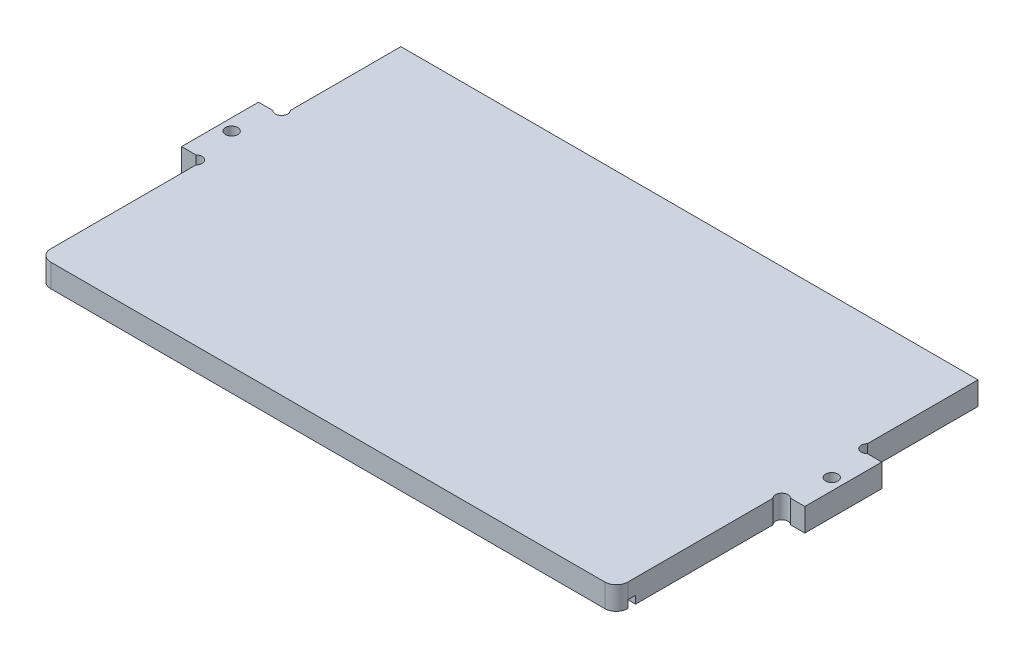
ISO-10303-21;
HEADER;
FILE_DESCRIPTION(('STEP AP214'),'2;1');
FILE_NAME('part.step','',(''),(''),'','','');
FILE_SCHEMA(('AUTOMOTIVE_DESIGN { 1 0 10303 214 1 1 1 1 }'));
ENDSEC;
DATA;
#1=APPLICATION_CONTEXT('core data for automotive mechanical design processes');
#2=APPLICATION_PROTOCOL_DEFINITION('international standard','automotive_design',2000,#1);
#3=PRODUCT_CONTEXT('',#1,'mechanical');
#4=PRODUCT('Part','Part','',(#3));
#5=PRODUCT_RELATED_PRODUCT_CATEGORY('part','',(#4));
#6=PRODUCT_DEFINITION_FORMATION('','',#4);
#7=PRODUCT_DEFINITION_CONTEXT('part definition',#1,'design');
#8=PRODUCT_DEFINITION('design','',#6,#7);
#9=PRODUCT_DEFINITION_SHAPE('','',#8);
#10=(LENGTH_UNIT() NAMED_UNIT(*) SI_UNIT(.MILLI.,.METRE.));
#11=(NAMED_UNIT(*) PLANE_ANGLE_UNIT() SI_UNIT($,.RADIAN.));
#12=(NAMED_UNIT(*) SI_UNIT($,.STERADIAN.) SOLID_ANGLE_UNIT());
#13=UNCERTAINTY_MEASURE_WITH_UNIT(LENGTH_MEASURE(1.E-05),#10,'distance_accuracy_value','');
#14=(GEOMETRIC_REPRESENTATION_CONTEXT(3) GLOBAL_UNCERTAINTY_ASSIGNED_CONTEXT((#13)) GLOBAL_UNIT_ASSIGNED_CONTEXT((#10,
#11,#12)) REPRESENTATION_CONTEXT('',''));
#15=CARTESIAN_POINT('',(0.,0.,0.));
#16=DIRECTION('',(0.,0.,1.));
#17=DIRECTION('',(1.,0.,0.));
#18=AXIS2_PLACEMENT_3D('',#15,#16,#17);
#19=CARTESIAN_POINT('',(4.86862915010156,0.,-32.8686291501015));
#20=DIRECTION('',(0.,1.,0.));
#21=DIRECTION('',(0.,0.,1.));
#22=AXIS2_PLACEMENT_3D('',#19,#20,#21);
#23=PLANE('',#22);
#24=CARTESIAN_POINT('',(9.00000000000001,0.,6.));
#25=DIRECTION('',(0.,1.,0.));
#26=DIRECTION('',(0.,0.,1.));
#27=AXIS2_PLACEMENT_3D('',#24,#25,#26);
#28=CIRCLE('',#27,3.);
#29=CARTESIAN_POINT('',(6.00000000000001,0.,6.));
#30=VERTEX_POINT('',#29);
#31=CARTESIAN_POINT('',(9.00000000000001,0.,9.));
#32=VERTEX_POINT('',#31);
#33=EDGE_CURVE('E203',#30,#32,#28,.T.);
#34=ORIENTED_EDGE('',*,*,#33,.F.);
#35=DIRECTION('',(-1.,0.,0.));
#36=VECTOR('',#35,1.);
#37=CARTESIAN_POINT('',(6.00000000000001,0.,6.));
#38=LINE('',#37,#36);
#39=CARTESIAN_POINT('',(156.,0.,6.));
#40=VERTEX_POINT('',#39);
#41=EDGE_CURVE('E293',#40,#30,#38,.T.);
#42=ORIENTED_EDGE('',*,*,#41,.F.);
#43=CARTESIAN_POINT('',(153.,0.,6.));
#44=DIRECTION('',(0.,1.,0.));
#45=DIRECTION('',(0.,0.,1.));
#46=AXIS2_PLACEMENT_3D('',#43,#44,#45);
#47=CIRCLE('',#46,3.);
#48=CARTESIAN_POINT('',(153.,0.,9.));
#49=VERTEX_POINT('',#48);
#50=EDGE_CURVE('E207',#49,#40,#47,.T.);
#51=ORIENTED_EDGE('',*,*,#50,.F.);
#52=DIRECTION('',(1.,0.,0.));
#53=VECTOR('',#52,1.);
#54=CARTESIAN_POINT('',(9.00000000000001,0.,9.));
#55=LINE('',#54,#53);
#56=EDGE_CURVE('E205',#32,#49,#55,.T.);
#57=ORIENTED_EDGE('',*,*,#56,.F.);
#58=EDGE_LOOP('',(#34,#42,#51,#57));
#59=FACE_BOUND('',#58,.T.);
#60=ADVANCED_FACE('F32',(#59),#23,.F.);
#61=CARTESIAN_POINT('',(4.86862915010156,6.,-32.8686291501015));
#62=DIRECTION('',(0.,1.,0.));
#63=DIRECTION('',(0.,0.,1.));
#64=AXIS2_PLACEMENT_3D('',#61,#62,#63);
#65=PLANE('',#64);
#66=CARTESIAN_POINT('',(3.00000000000003,6.,-44.));
#67=DIRECTION('',(0.,1.,0.));
#68=DIRECTION('',(0.,0.,1.));
#69=AXIS2_PLACEMENT_3D('',#66,#67,#68);
#70=CIRCLE('',#69,1.6);
#71=CARTESIAN_POINT('',(3.00000000000003,6.,-42.4));
#72=VERTEX_POINT('',#71);
#73=EDGE_CURVE('E200',#72,#72,#70,.T.);
#74=ORIENTED_EDGE('',*,*,#73,.F.);
#75=EDGE_LOOP('',(#74));
#76=FACE_BOUND('',#75,.T.);
#77=CARTESIAN_POINT('',(4.86862915010156,6.,-32.8686291501015));
#78=DIRECTION('',(0.,-1.,0.));
#79=DIRECTION('',(0.,0.,1.));
#80=AXIS2_PLACEMENT_3D('',#77,#78,#79);
#81=CIRCLE('',#80,1.59999999999995);
#82=CARTESIAN_POINT('',(3.73725830020311,6.,-34.));
#83=VERTEX_POINT('',#82);
#84=CARTESIAN_POINT('',(6.00000000000001,6.,-31.7372583002031));
#85=VERTEX_POINT('',#84);
#86=EDGE_CURVE('E234',#83,#85,#81,.T.);
#87=ORIENTED_EDGE('',*,*,#86,.T.);
#88=DIRECTION('',(0.,0.,1.));
#89=VECTOR('',#88,1.);
#90=CARTESIAN_POINT('',(6.00000000000001,6.,-31.7372583002031));
#91=LINE('',#90,#89);
#92=CARTESIAN_POINT('',(6.00000000000001,6.,6.));
#93=VERTEX_POINT('',#92);
#94=EDGE_CURVE('E121',#85,#93,#91,.T.);
#95=ORIENTED_EDGE('',*,*,#94,.T.);
#96=CARTESIAN_POINT('',(9.00000000000001,6.,6.));
#97=DIRECTION('',(0.,1.,0.));
#98=DIRECTION('',(0.,0.,1.));
#99=AXIS2_PLACEMENT_3D('',#96,#97,#98);
#100=CIRCLE('',#99,3.);
#101=CARTESIAN_POINT('',(9.00000000000001,6.,9.));
#102=VERTEX_POINT('',#101);
#103=EDGE_CURVE('E282',#93,#102,#100,.T.);
#104=ORIENTED_EDGE('',*,*,#103,.T.);
#105=DIRECTION('',(1.,0.,0.));
#106=VECTOR('',#105,1.);
#107=CARTESIAN_POINT('',(9.00000000000001,6.,9.));
#108=LINE('',#107,#106);
#109=CARTESIAN_POINT('',(153.,6.,9.));
#110=VERTEX_POINT('',#109);
#111=EDGE_CURVE('E328',#102,#110,#108,.T.);
#112=ORIENTED_EDGE('',*,*,#111,.T.);
#113=CARTESIAN_POINT('',(153.,6.,6.));
#114=DIRECTION('',(0.,1.,0.));
#115=DIRECTION('',(0.,0.,1.));
#116=AXIS2_PLACEMENT_3D('',#113,#114,#115);
#117=CIRCLE('',#116,3.);
#118=CARTESIAN_POINT('',(156.,6.,6.));
#119=VERTEX_POINT('',#118);
#120=EDGE_CURVE('E330',#110,#119,#117,.T.);
#121=ORIENTED_EDGE('',*,*,#120,.T.);
#122=DIRECTION('',(0.,0.,-1.));
#123=VECTOR('',#122,1.);
#124=CARTESIAN_POINT('',(156.,6.,6.));
#125=LINE('',#124,#123);
#126=CARTESIAN_POINT('',(156.,6.,-31.7372583002031));
#127=VERTEX_POINT('',#126);
#128=EDGE_CURVE('E332',#119,#127,#125,.T.);
#129=ORIENTED_EDGE('',*,*,#128,.T.);
#130=CARTESIAN_POINT('',(157.131370849898,6.,-32.8686291501015));
#131=DIRECTION('',(0.,-1.,0.));
#132=DIRECTION('',(0.,0.,-1.));
#133=AXIS2_PLACEMENT_3D('',#130,#131,#132);
#134=CIRCLE('',#133,1.59999999999998);
#135=CARTESIAN_POINT('',(158.262741699797,6.,-34.));
#136=VERTEX_POINT('',#135);
#137=EDGE_CURVE('E334',#127,#136,#134,.T.);
#138=ORIENTED_EDGE('',*,*,#137,.T.);
#139=DIRECTION('',(1.,0.,0.));
#140=VECTOR('',#139,1.);
#141=CARTESIAN_POINT('',(162.,6.,-34.));
#142=LINE('',#141,#140);
#143=CARTESIAN_POINT('',(162.,6.,-34.));
#144=VERTEX_POINT('',#143);
#145=EDGE_CURVE('E336',#136,#144,#142,.T.);
#146=ORIENTED_EDGE('',*,*,#145,.T.);
#147=DIRECTION('',(0.,0.,-1.));
#148=VECTOR('',#147,1.);
#149=CARTESIAN_POINT('',(162.,6.,-54.));
#150=LINE('',#149,#148);
#151=CARTESIAN_POINT('',(162.,6.,-54.));
#152=VERTEX_POINT('',#151);
#153=EDGE_CURVE('E338',#144,#152,#150,.T.);
#154=ORIENTED_EDGE('',*,*,#153,.T.);
#155=DIRECTION('',(-1.,0.,0.));
#156=VECTOR('',#155,1.);
#157=CARTESIAN_POINT('',(158.262741699797,6.,-54.));
#158=LINE('',#157,#156);
#159=CARTESIAN_POINT('',(158.262741699797,6.,-54.));
#160=VERTEX_POINT('',#159);
#161=EDGE_CURVE('E340',#152,#160,#158,.T.);
#162=ORIENTED_EDGE('',*,*,#161,.T.);
#163=CARTESIAN_POINT('',(157.131370849898,6.,-55.1313708498984));
#164=DIRECTION('',(0.,-1.,0.));
#165=DIRECTION('',(0.,0.,1.));
#166=AXIS2_PLACEMENT_3D('',#163,#164,#165);
#167=CIRCLE('',#166,1.59999999999999);
#168=CARTESIAN_POINT('',(156.,6.,-56.2627416997969));
#169=VERTEX_POINT('',#168);
#170=EDGE_CURVE('E342',#160,#169,#167,.T.);
#171=ORIENTED_EDGE('',*,*,#170,.T.);
#172=DIRECTION('',(0.,0.,-1.));
#173=VECTOR('',#172,1.);
#174=CARTESIAN_POINT('',(156.,6.,-56.2627416997969));
#175=LINE('',#174,#173);
#176=CARTESIAN_POINT('',(156.,6.,-85.));
#177=VERTEX_POINT('',#176);
#178=EDGE_CURVE('E344',#169,#177,#175,.T.);
#179=ORIENTED_EDGE('',*,*,#178,.T.);
#180=DIRECTION('',(-1.,0.,0.));
#181=VECTOR('',#180,1.);
#182=CARTESIAN_POINT('',(6.00000000000012,6.,-85.));
#183=LINE('',#182,#181);
#184=CARTESIAN_POINT('',(6.00000000000012,6.,-85.));
#185=VERTEX_POINT('',#184);
#186=EDGE_CURVE('E346',#177,#185,#183,.T.);
#187=ORIENTED_EDGE('',*,*,#186,.T.);
#188=DIRECTION('',(0.,0.,1.));
#189=VECTOR('',#188,1.);
#190=CARTESIAN_POINT('',(6.00000000000012,6.,-56.2627416997969));
#191=LINE('',#190,#189);
#192=CARTESIAN_POINT('',(6.00000000000012,6.,-56.2627416997969));
#193=VERTEX_POINT('',#192);
#194=EDGE_CURVE('E348',#185,#193,#191,.T.);
#195=ORIENTED_EDGE('',*,*,#194,.T.);
#196=CARTESIAN_POINT('',(4.86862915010165,6.,-55.1313708498984));
#197=DIRECTION('',(0.,-1.,0.));
#198=DIRECTION('',(0.,0.,-1.));
#199=AXIS2_PLACEMENT_3D('',#196,#197,#198);
#200=CIRCLE('',#199,1.59999999999999);
#201=CARTESIAN_POINT('',(3.73725830020318,6.,-54.));
#202=VERTEX_POINT('',#201);
#203=EDGE_CURVE('E175',#193,#202,#200,.T.);
#204=ORIENTED_EDGE('',*,*,#203,.T.);
#205=DIRECTION('',(-1.,0.,0.));
#206=VECTOR('',#205,1.);
#207=CARTESIAN_POINT('',(3.73725830020318,6.,-54.));
#208=LINE('',#207,#206);
#209=CARTESIAN_POINT('',(0.,6.,-54.));
#210=VERTEX_POINT('',#209);
#211=EDGE_CURVE('E167',#202,#210,#208,.T.);
#212=ORIENTED_EDGE('',*,*,#211,.T.);
#213=DIRECTION('',(0.,0.,1.));
#214=VECTOR('',#213,1.);
#215=CARTESIAN_POINT('',(0.,6.,-54.));
#216=LINE('',#215,#214);
#217=CARTESIAN_POINT('',(0.,6.,-34.));
#218=VERTEX_POINT('',#217);
#219=EDGE_CURVE('E172',#210,#218,#216,.T.);
#220=ORIENTED_EDGE('',*,*,#219,.T.);
#221=DIRECTION('',(1.,0.,0.));
#222=VECTOR('',#221,1.);
#223=CARTESIAN_POINT('',(0.,6.,-34.));
#224=LINE('',#223,#222);
#225=EDGE_CURVE('E56',#218,#83,#224,.T.);
#226=ORIENTED_EDGE('',*,*,#225,.T.);
#227=EDGE_LOOP('',(#87,#95,#104,#112,#121,#129,#138,#146,#154,#162,#171,#179,#187,#195,#204,
#212,#220,#226));
#228=FACE_BOUND('',#227,.T.);
#229=CARTESIAN_POINT('',(159.,6.,-44.));
#230=DIRECTION('',(0.,1.,0.));
#231=DIRECTION('',(0.,0.,-1.));
#232=AXIS2_PLACEMENT_3D('',#229,#230,#231);
#233=CIRCLE('',#232,1.60000000000002);
#234=CARTESIAN_POINT('',(159.,6.,-45.6));
#235=VERTEX_POINT('',#234);
#236=EDGE_CURVE('E315',#235,#235,#233,.T.);
#237=ORIENTED_EDGE('',*,*,#236,.F.);
#238=EDGE_LOOP('',(#237));
#239=FACE_BOUND('',#238,.T.);
#240=ADVANCED_FACE('F169',(#76,#228,#239),#65,.T.);
#241=CARTESIAN_POINT('',(3.00000000000003,0.,-44.));
#242=DIRECTION('',(0.,1.,0.));
#243=DIRECTION('',(0.,0.,1.));
#244=AXIS2_PLACEMENT_3D('',#241,#242,#243);
#245=CIRCLE('',#244,1.6);
#246=CARTESIAN_POINT('',(3.00000000000003,0.,-42.4));
#247=VERTEX_POINT('',#246);
#248=EDGE_CURVE('E318',#247,#247,#245,.T.);
#249=ORIENTED_EDGE('',*,*,#248,.T.);
#250=EDGE_LOOP('',(#249));
#251=FACE_BOUND('',#250,.T.);
#252=DIRECTION('',(0.,0.,-1.));
#253=VECTOR('',#252,1.);
#254=CARTESIAN_POINT('',(156.,0.,6.));
#255=LINE('',#254,#253);
#256=CARTESIAN_POINT('',(156.,0.,3.99999999999998));
#257=VERTEX_POINT('',#256);
#258=CARTESIAN_POINT('',(156.,0.,-31.7372583002031));
#259=VERTEX_POINT('',#258);
#260=EDGE_CURVE('E210',#257,#259,#255,.T.);
#261=ORIENTED_EDGE('',*,*,#260,.F.);
#262=DIRECTION('',(1.,0.,0.));
#263=VECTOR('',#262,1.);
#264=CARTESIAN_POINT('',(6.00000000000001,0.,3.99999999999998));
#265=LINE('',#264,#263);
#266=CARTESIAN_POINT('',(6.00000000000001,0.,3.99999999999998));
#267=VERTEX_POINT('',#266);
#268=EDGE_CURVE('E298',#267,#257,#265,.T.);
#269=ORIENTED_EDGE('',*,*,#268,.F.);
#270=DIRECTION('',(0.,0.,1.));
#271=VECTOR('',#270,1.);
#272=CARTESIAN_POINT('',(6.00000000000001,0.,-31.7372583002031));
#273=LINE('',#272,#271);
#274=CARTESIAN_POINT('',(6.00000000000001,0.,-31.7372583002031));
#275=VERTEX_POINT('',#274);
#276=EDGE_CURVE('E199',#275,#267,#273,.T.);
#277=ORIENTED_EDGE('',*,*,#276,.F.);
#278=CARTESIAN_POINT('',(4.86862915010156,0.,-32.8686291501015));
#279=DIRECTION('',(0.,-1.,0.));
#280=DIRECTION('',(0.,0.,1.));
#281=AXIS2_PLACEMENT_3D('',#278,#279,#280);
#282=CIRCLE('',#281,1.59999999999995);
#283=CARTESIAN_POINT('',(3.73725830020311,0.,-34.));
#284=VERTEX_POINT('',#283);
#285=EDGE_CURVE('E196',#284,#275,#282,.T.);
#286=ORIENTED_EDGE('',*,*,#285,.F.);
#287=DIRECTION('',(1.,0.,0.));
#288=VECTOR('',#287,1.);
#289=CARTESIAN_POINT('',(0.,0.,-34.));
#290=LINE('',#289,#288);
#291=CARTESIAN_POINT('',(0.,0.,-34.));
#292=VERTEX_POINT('',#291);
#293=EDGE_CURVE('E113',#292,#284,#290,.T.);
#294=ORIENTED_EDGE('',*,*,#293,.F.);
#295=DIRECTION('',(0.,0.,1.));
#296=VECTOR('',#295,1.);
#297=CARTESIAN_POINT('',(0.,0.,-54.));
#298=LINE('',#297,#296);
#299=CARTESIAN_POINT('',(0.,0.,-54.));
#300=VERTEX_POINT('',#299);
#301=EDGE_CURVE('E231',#300,#292,#298,.T.);
#302=ORIENTED_EDGE('',*,*,#301,.F.);
#303=DIRECTION('',(-1.,0.,0.));
#304=VECTOR('',#303,1.);
#305=CARTESIAN_POINT('',(3.73725830020318,0.,-54.));
#306=LINE('',#305,#304);
#307=CARTESIAN_POINT('',(3.73725830020318,0.,-54.));
#308=VERTEX_POINT('',#307);
#309=EDGE_CURVE('E184',#308,#300,#306,.T.);
#310=ORIENTED_EDGE('',*,*,#309,.F.);
#311=CARTESIAN_POINT('',(4.86862915010165,0.,-55.1313708498984));
#312=DIRECTION('',(0.,-1.,0.));
#313=DIRECTION('',(0.,0.,-1.));
#314=AXIS2_PLACEMENT_3D('',#311,#312,#313);
#315=CIRCLE('',#314,1.59999999999999);
#316=CARTESIAN_POINT('',(6.00000000000012,0.,-56.2627416997969));
#317=VERTEX_POINT('',#316);
#318=EDGE_CURVE('E228',#317,#308,#315,.T.);
#319=ORIENTED_EDGE('',*,*,#318,.F.);
#320=DIRECTION('',(0.,0.,1.));
#321=VECTOR('',#320,1.);
#322=CARTESIAN_POINT('',(6.00000000000012,0.,-56.2627416997969));
#323=LINE('',#322,#321);
#324=CARTESIAN_POINT('',(6.00000000000012,0.,-85.));
#325=VERTEX_POINT('',#324);
#326=EDGE_CURVE('E226',#325,#317,#323,.T.);
#327=ORIENTED_EDGE('',*,*,#326,.F.);
#328=DIRECTION('',(-1.,0.,0.));
#329=VECTOR('',#328,1.);
#330=CARTESIAN_POINT('',(6.00000000000012,0.,-85.));
#331=LINE('',#330,#329);
#332=CARTESIAN_POINT('',(156.,0.,-85.));
#333=VERTEX_POINT('',#332);
#334=EDGE_CURVE('E224',#333,#325,#331,.T.);
#335=ORIENTED_EDGE('',*,*,#334,.F.);
#336=DIRECTION('',(0.,0.,-1.));
#337=VECTOR('',#336,1.);
#338=CARTESIAN_POINT('',(156.,0.,-56.2627416997969));
#339=LINE('',#338,#337);
#340=CARTESIAN_POINT('',(156.,0.,-56.2627416997969));
#341=VERTEX_POINT('',#340);
#342=EDGE_CURVE('E222',#341,#333,#339,.T.);
#343=ORIENTED_EDGE('',*,*,#342,.F.);
#344=CARTESIAN_POINT('',(157.131370849898,0.,-55.1313708498984));
#345=DIRECTION('',(0.,-1.,0.));
#346=DIRECTION('',(0.,0.,1.));
#347=AXIS2_PLACEMENT_3D('',#344,#345,#346);
#348=CIRCLE('',#347,1.59999999999999);
#349=CARTESIAN_POINT('',(158.262741699797,0.,-54.));
#350=VERTEX_POINT('',#349);
#351=EDGE_CURVE('E220',#350,#341,#348,.T.);
#352=ORIENTED_EDGE('',*,*,#351,.F.);
#353=DIRECTION('',(-1.,0.,0.));
#354=VECTOR('',#353,1.);
#355=CARTESIAN_POINT('',(158.262741699797,0.,-54.));
#356=LINE('',#355,#354);
#357=CARTESIAN_POINT('',(162.,0.,-54.));
#358=VERTEX_POINT('',#357);
#359=EDGE_CURVE('E218',#358,#350,#356,.T.);
#360=ORIENTED_EDGE('',*,*,#359,.F.);
#361=DIRECTION('',(0.,0.,-1.));
#362=VECTOR('',#361,1.);
#363=CARTESIAN_POINT('',(162.,0.,-54.));
#364=LINE('',#363,#362);
#365=CARTESIAN_POINT('',(162.,0.,-34.));
#366=VERTEX_POINT('',#365);
#367=EDGE_CURVE('E216',#366,#358,#364,.T.);
#368=ORIENTED_EDGE('',*,*,#367,.F.);
#369=DIRECTION('',(1.,0.,0.));
#370=VECTOR('',#369,1.);
#371=CARTESIAN_POINT('',(162.,0.,-34.));
#372=LINE('',#371,#370);
#373=CARTESIAN_POINT('',(158.262741699797,0.,-34.));
#374=VERTEX_POINT('',#373);
#375=EDGE_CURVE('E214',#374,#366,#372,.T.);
#376=ORIENTED_EDGE('',*,*,#375,.F.);
#377=CARTESIAN_POINT('',(157.131370849898,0.,-32.8686291501015));
#378=DIRECTION('',(0.,-1.,0.));
#379=DIRECTION('',(0.,0.,-1.));
#380=AXIS2_PLACEMENT_3D('',#377,#378,#379);
#381=CIRCLE('',#380,1.59999999999998);
#382=EDGE_CURVE('E212',#259,#374,#381,.T.);
#383=ORIENTED_EDGE('',*,*,#382,.F.);
#384=EDGE_LOOP('',(#261,#269,#277,#286,#294,#302,#310,#319,#327,#335,#343,#352,#360,#368,#376,#383));
#385=FACE_BOUND('',#384,.T.);
#386=CARTESIAN_POINT('',(159.,0.,-44.));
#387=DIRECTION('',(0.,1.,0.));
#388=DIRECTION('',(0.,0.,-1.));
#389=AXIS2_PLACEMENT_3D('',#386,#387,#388);
#390=CIRCLE('',#389,1.60000000000002);
#391=CARTESIAN_POINT('',(159.,0.,-45.6));
#392=VERTEX_POINT('',#391);
#393=EDGE_CURVE('E307',#392,#392,#390,.T.);
#394=ORIENTED_EDGE('',*,*,#393,.T.);
#395=EDGE_LOOP('',(#394));
#396=FACE_BOUND('',#395,.T.);
#397=ADVANCED_FACE('F361',(#251,#385,#396),#23,.F.);
#398=CARTESIAN_POINT('',(4.86862915010156,6.,-32.8686291501015));
#399=DIRECTION('',(0.,-1.,0.));
#400=DIRECTION('',(0.,0.,-1.));
#401=AXIS2_PLACEMENT_3D('',#398,#399,#400);
#402=CYLINDRICAL_SURFACE('',#401,1.59999999999995);
#403=ORIENTED_EDGE('',*,*,#285,.T.);
#404=DIRECTION('',(0.,-1.,0.));
#405=VECTOR('',#404,1.);
#406=CARTESIAN_POINT('',(6.00000000000001,6.,-31.7372583002031));
#407=LINE('',#406,#405);
#408=EDGE_CURVE('E11',#85,#275,#407,.T.);
#409=ORIENTED_EDGE('',*,*,#408,.F.);
#410=ORIENTED_EDGE('',*,*,#86,.F.);
#411=DIRECTION('',(0.,-1.,0.));
#412=VECTOR('',#411,1.);
#413=CARTESIAN_POINT('',(3.73725830020311,6.,-34.));
#414=LINE('',#413,#412);
#415=EDGE_CURVE('E192',#83,#284,#414,.T.);
#416=ORIENTED_EDGE('',*,*,#415,.T.);
#417=EDGE_LOOP('',(#403,#409,#410,#416));
#418=FACE_BOUND('',#417,.T.);
#419=ADVANCED_FACE('F34',(#418),#402,.F.);
#420=CARTESIAN_POINT('',(6.00000000000001,6.,-31.7372583002031));
#421=DIRECTION('',(1.,0.,0.));
#422=DIRECTION('',(0.,0.,-1.));
#423=AXIS2_PLACEMENT_3D('',#420,#421,#422);
#424=PLANE('',#423);
#425=ORIENTED_EDGE('',*,*,#276,.T.);
#426=DIRECTION('',(0.,-1.,0.));
#427=VECTOR('',#426,1.);
#428=CARTESIAN_POINT('',(6.00000000000001,2.,3.99999999999998));
#429=LINE('',#428,#427);
#430=CARTESIAN_POINT('',(6.00000000000001,2.,3.99999999999998));
#431=VERTEX_POINT('',#430);
#432=EDGE_CURVE('E291',#431,#267,#429,.T.);
#433=ORIENTED_EDGE('',*,*,#432,.F.);
#434=DIRECTION('',(0.,0.,-1.));
#435=VECTOR('',#434,1.);
#436=CARTESIAN_POINT('',(6.00000000000001,2.,6.));
#437=LINE('',#436,#435);
#438=CARTESIAN_POINT('',(6.00000000000001,2.,6.));
#439=VERTEX_POINT('',#438);
#440=EDGE_CURVE('E288',#439,#431,#437,.T.);
#441=ORIENTED_EDGE('',*,*,#440,.F.);
#442=DIRECTION('',(0.,-1.,0.));
#443=VECTOR('',#442,1.);
#444=CARTESIAN_POINT('',(6.00000000000001,6.,6.));
#445=LINE('',#444,#443);
#446=EDGE_CURVE('E40',#93,#439,#445,.T.);
#447=ORIENTED_EDGE('',*,*,#446,.F.);
#448=ORIENTED_EDGE('',*,*,#94,.F.);
#449=ORIENTED_EDGE('',*,*,#408,.T.);
#450=EDGE_LOOP('',(#425,#433,#441,#447,#448,#449));
#451=FACE_BOUND('',#450,.T.);
#452=ADVANCED_FACE('F286',(#451),#424,.F.);
#453=CARTESIAN_POINT('',(9.00000000000001,6.,6.));
#454=DIRECTION('',(0.,-1.,0.));
#455=DIRECTION('',(0.,0.,-1.));
#456=AXIS2_PLACEMENT_3D('',#453,#454,#455);
#457=CYLINDRICAL_SURFACE('',#456,3.);
#458=ORIENTED_EDGE('',*,*,#33,.T.);
#459=DIRECTION('',(0.,-1.,0.));
#460=VECTOR('',#459,1.);
#461=CARTESIAN_POINT('',(9.00000000000001,6.,9.));
#462=LINE('',#461,#460);
#463=EDGE_CURVE('E271',#102,#32,#462,.T.);
#464=ORIENTED_EDGE('',*,*,#463,.F.);
#465=ORIENTED_EDGE('',*,*,#103,.F.);
#466=ORIENTED_EDGE('',*,*,#446,.T.);
#467=DIRECTION('',(0.,-1.,0.));
#468=VECTOR('',#467,1.);
#469=CARTESIAN_POINT('',(6.00000000000001,2.,6.));
#470=LINE('',#469,#468);
#471=EDGE_CURVE('E279',#439,#30,#470,.T.);
#472=ORIENTED_EDGE('',*,*,#471,.T.);
#473=EDGE_LOOP('',(#458,#464,#465,#466,#472));
#474=FACE_BOUND('',#473,.T.);
#475=ADVANCED_FACE('F277',(#474),#457,.T.);
#476=CARTESIAN_POINT('',(9.00000000000001,6.,9.));
#477=DIRECTION('',(0.,0.,-1.));
#478=DIRECTION('',(-1.,0.,0.));
#479=AXIS2_PLACEMENT_3D('',#476,#477,#478);
#480=PLANE('',#479);
#481=ORIENTED_EDGE('',*,*,#56,.T.);
#482=DIRECTION('',(0.,-1.,0.));
#483=VECTOR('',#482,1.);
#484=CARTESIAN_POINT('',(153.,6.,9.));
#485=LINE('',#484,#483);
#486=EDGE_CURVE('E268',#110,#49,#485,.T.);
#487=ORIENTED_EDGE('',*,*,#486,.F.);
#488=ORIENTED_EDGE('',*,*,#111,.F.);
#489=ORIENTED_EDGE('',*,*,#463,.T.);
#490=EDGE_LOOP('',(#481,#487,#488,#489));
#491=FACE_BOUND('',#490,.T.);
#492=ADVANCED_FACE('F372',(#491),#480,.F.);
#493=CARTESIAN_POINT('',(153.,6.,6.));
#494=DIRECTION('',(0.,-1.,0.));
#495=DIRECTION('',(0.,0.,-1.));
#496=AXIS2_PLACEMENT_3D('',#493,#494,#495);
#497=CYLINDRICAL_SURFACE('',#496,3.);
#498=ORIENTED_EDGE('',*,*,#50,.T.);
#499=DIRECTION('',(0.,-1.,0.));
#500=VECTOR('',#499,1.);
#501=CARTESIAN_POINT('',(156.,2.,6.));
#502=LINE('',#501,#500);
#503=CARTESIAN_POINT('',(156.,2.,6.));
#504=VERTEX_POINT('',#503);
#505=EDGE_CURVE('E308',#504,#40,#502,.T.);
#506=ORIENTED_EDGE('',*,*,#505,.F.);
#507=DIRECTION('',(0.,-1.,0.));
#508=VECTOR('',#507,1.);
#509=CARTESIAN_POINT('',(156.,6.,6.));
#510=LINE('',#509,#508);
#511=EDGE_CURVE('E265',#119,#504,#510,.T.);
#512=ORIENTED_EDGE('',*,*,#511,.F.);
#513=ORIENTED_EDGE('',*,*,#120,.F.);
#514=ORIENTED_EDGE('',*,*,#486,.T.);
#515=EDGE_LOOP('',(#498,#506,#512,#513,#514));
#516=FACE_BOUND('',#515,.T.);
#517=ADVANCED_FACE('F377',(#516),#497,.T.);
#518=CARTESIAN_POINT('',(156.,6.,6.));
#519=DIRECTION('',(-1.,0.,0.));
#520=DIRECTION('',(0.,0.,1.));
#521=AXIS2_PLACEMENT_3D('',#518,#519,#520);
#522=PLANE('',#521);
#523=DIRECTION('',(0.,0.,1.));
#524=VECTOR('',#523,1.);
#525=CARTESIAN_POINT('',(156.,2.,6.));
#526=LINE('',#525,#524);
#527=CARTESIAN_POINT('',(156.,2.,3.99999999999998));
#528=VERTEX_POINT('',#527);
#529=EDGE_CURVE('E295',#528,#504,#526,.T.);
#530=ORIENTED_EDGE('',*,*,#529,.F.);
#531=DIRECTION('',(0.,-1.,0.));
#532=VECTOR('',#531,1.);
#533=CARTESIAN_POINT('',(156.,2.,3.99999999999998));
#534=LINE('',#533,#532);
#535=EDGE_CURVE('E311',#528,#257,#534,.T.);
#536=ORIENTED_EDGE('',*,*,#535,.T.);
#537=ORIENTED_EDGE('',*,*,#260,.T.);
#538=DIRECTION('',(0.,-1.,0.));
#539=VECTOR('',#538,1.);
#540=CARTESIAN_POINT('',(156.,6.,-31.7372583002031));
#541=LINE('',#540,#539);
#542=EDGE_CURVE('E262',#127,#259,#541,.T.);
#543=ORIENTED_EDGE('',*,*,#542,.F.);
#544=ORIENTED_EDGE('',*,*,#128,.F.);
#545=ORIENTED_EDGE('',*,*,#511,.T.);
#546=EDGE_LOOP('',(#530,#536,#537,#543,#544,#545));
#547=FACE_BOUND('',#546,.T.);
#548=ADVANCED_FACE('F385',(#547),#522,.F.);
#549=CARTESIAN_POINT('',(157.131370849898,6.,-32.8686291501015));
#550=DIRECTION('',(0.,-1.,0.));
#551=DIRECTION('',(0.,0.,-1.));
#552=AXIS2_PLACEMENT_3D('',#549,#550,#551);
#553=CYLINDRICAL_SURFACE('',#552,1.59999999999998);
#554=ORIENTED_EDGE('',*,*,#382,.T.);
#555=DIRECTION('',(0.,-1.,0.));
#556=VECTOR('',#555,1.);
#557=CARTESIAN_POINT('',(158.262741699797,6.,-34.));
#558=LINE('',#557,#556);
#559=EDGE_CURVE('E259',#136,#374,#558,.T.);
#560=ORIENTED_EDGE('',*,*,#559,.F.);
#561=ORIENTED_EDGE('',*,*,#137,.F.);
#562=ORIENTED_EDGE('',*,*,#542,.T.);
#563=EDGE_LOOP('',(#554,#560,#561,#562));
#564=FACE_BOUND('',#563,.T.);
#565=ADVANCED_FACE('F388',(#564),#553,.F.);
#566=CARTESIAN_POINT('',(162.,6.,-34.));
#567=DIRECTION('',(0.,0.,-1.));
#568=DIRECTION('',(-1.,0.,0.));
#569=AXIS2_PLACEMENT_3D('',#566,#567,#568);
#570=PLANE('',#569);
#571=ORIENTED_EDGE('',*,*,#375,.T.);
#572=DIRECTION('',(0.,-1.,0.));
#573=VECTOR('',#572,1.);
#574=CARTESIAN_POINT('',(162.,6.,-34.));
#575=LINE('',#574,#573);
#576=EDGE_CURVE('E256',#144,#366,#575,.T.);
#577=ORIENTED_EDGE('',*,*,#576,.F.);
#578=ORIENTED_EDGE('',*,*,#145,.F.);
#579=ORIENTED_EDGE('',*,*,#559,.T.);
#580=EDGE_LOOP('',(#571,#577,#578,#579));
#581=FACE_BOUND('',#580,.T.);
#582=ADVANCED_FACE('F393',(#581),#570,.F.);
#583=CARTESIAN_POINT('',(162.,6.,-54.));
#584=DIRECTION('',(-1.,0.,0.));
#585=DIRECTION('',(0.,0.,1.));
#586=AXIS2_PLACEMENT_3D('',#583,#584,#585);
#587=PLANE('',#586);
#588=ORIENTED_EDGE('',*,*,#367,.T.);
#589=DIRECTION('',(0.,-1.,0.));
#590=VECTOR('',#589,1.);
#591=CARTESIAN_POINT('',(162.,6.,-54.));
#592=LINE('',#591,#590);
#593=EDGE_CURVE('E253',#152,#358,#592,.T.);
#594=ORIENTED_EDGE('',*,*,#593,.F.);
#595=ORIENTED_EDGE('',*,*,#153,.F.);
#596=ORIENTED_EDGE('',*,*,#576,.T.);
#597=EDGE_LOOP('',(#588,#594,#595,#596));
#598=FACE_BOUND('',#597,.T.);
#599=ADVANCED_FACE('F399',(#598),#587,.F.);
#600=CARTESIAN_POINT('',(158.262741699797,6.,-54.));
#601=DIRECTION('',(0.,0.,1.));
#602=DIRECTION('',(1.,0.,0.));
#603=AXIS2_PLACEMENT_3D('',#600,#601,#602);
#604=PLANE('',#603);
#605=ORIENTED_EDGE('',*,*,#359,.T.);
#606=DIRECTION('',(0.,-1.,0.));
#607=VECTOR('',#606,1.);
#608=CARTESIAN_POINT('',(158.262741699797,6.,-54.));
#609=LINE('',#608,#607);
#610=EDGE_CURVE('E250',#160,#350,#609,.T.);
#611=ORIENTED_EDGE('',*,*,#610,.F.);
#612=ORIENTED_EDGE('',*,*,#161,.F.);
#613=ORIENTED_EDGE('',*,*,#593,.T.);
#614=EDGE_LOOP('',(#605,#611,#612,#613));
#615=FACE_BOUND('',#614,.T.);
#616=ADVANCED_FACE('F403',(#615),#604,.F.);
#617=CARTESIAN_POINT('',(157.131370849898,6.,-55.1313708498984));
#618=DIRECTION('',(0.,-1.,0.));
#619=DIRECTION('',(0.,0.,-1.));
#620=AXIS2_PLACEMENT_3D('',#617,#618,#619);
#621=CYLINDRICAL_SURFACE('',#620,1.59999999999999);
#622=ORIENTED_EDGE('',*,*,#351,.T.);
#623=DIRECTION('',(0.,-1.,0.));
#624=VECTOR('',#623,1.);
#625=CARTESIAN_POINT('',(156.,6.,-56.2627416997969));
#626=LINE('',#625,#624);
#627=EDGE_CURVE('E247',#169,#341,#626,.T.);
#628=ORIENTED_EDGE('',*,*,#627,.F.);
#629=ORIENTED_EDGE('',*,*,#170,.F.);
#630=ORIENTED_EDGE('',*,*,#610,.T.);
#631=EDGE_LOOP('',(#622,#628,#629,#630));
#632=FACE_BOUND('',#631,.T.);
#633=ADVANCED_FACE('F408',(#632),#621,.F.);
#634=CARTESIAN_POINT('',(156.,6.,-56.2627416997969));
#635=DIRECTION('',(-1.,0.,0.));
#636=DIRECTION('',(0.,0.,1.));
#637=AXIS2_PLACEMENT_3D('',#634,#635,#636);
#638=PLANE('',#637);
#639=ORIENTED_EDGE('',*,*,#342,.T.);
#640=DIRECTION('',(0.,-1.,0.));
#641=VECTOR('',#640,1.);
#642=CARTESIAN_POINT('',(156.,6.,-85.));
#643=LINE('',#642,#641);
#644=EDGE_CURVE('E244',#177,#333,#643,.T.);
#645=ORIENTED_EDGE('',*,*,#644,.F.);
#646=ORIENTED_EDGE('',*,*,#178,.F.);
#647=ORIENTED_EDGE('',*,*,#627,.T.);
#648=EDGE_LOOP('',(#639,#645,#646,#647));
#649=FACE_BOUND('',#648,.T.);
#650=ADVANCED_FACE('F412',(#649),#638,.F.);
#651=CARTESIAN_POINT('',(6.00000000000012,6.,-85.));
#652=DIRECTION('',(0.,0.,1.));
#653=DIRECTION('',(1.,0.,0.));
#654=AXIS2_PLACEMENT_3D('',#651,#652,#653);
#655=PLANE('',#654);
#656=ORIENTED_EDGE('',*,*,#334,.T.);
#657=DIRECTION('',(0.,-1.,0.));
#658=VECTOR('',#657,1.);
#659=CARTESIAN_POINT('',(6.00000000000012,6.,-85.));
#660=LINE('',#659,#658);
#661=EDGE_CURVE('E241',#185,#325,#660,.T.);
#662=ORIENTED_EDGE('',*,*,#661,.F.);
#663=ORIENTED_EDGE('',*,*,#186,.F.);
#664=ORIENTED_EDGE('',*,*,#644,.T.);
#665=EDGE_LOOP('',(#656,#662,#663,#664));
#666=FACE_BOUND('',#665,.T.);
#667=ADVANCED_FACE('F416',(#666),#655,.F.);
#668=CARTESIAN_POINT('',(6.00000000000012,6.,-56.2627416997969));
#669=DIRECTION('',(1.,0.,0.));
#670=DIRECTION('',(0.,0.,-1.));
#671=AXIS2_PLACEMENT_3D('',#668,#669,#670);
#672=PLANE('',#671);
#673=ORIENTED_EDGE('',*,*,#326,.T.);
#674=DIRECTION('',(0.,-1.,0.));
#675=VECTOR('',#674,1.);
#676=CARTESIAN_POINT('',(6.00000000000012,6.,-56.2627416997969));
#677=LINE('',#676,#675);
#678=EDGE_CURVE('E238',#193,#317,#677,.T.);
#679=ORIENTED_EDGE('',*,*,#678,.F.);
#680=ORIENTED_EDGE('',*,*,#194,.F.);
#681=ORIENTED_EDGE('',*,*,#661,.T.);
#682=EDGE_LOOP('',(#673,#679,#680,#681));
#683=FACE_BOUND('',#682,.T.);
#684=ADVANCED_FACE('F354',(#683),#672,.F.);
#685=CARTESIAN_POINT('',(4.86862915010165,6.,-55.1313708498984));
#686=DIRECTION('',(0.,-1.,0.));
#687=DIRECTION('',(0.,0.,-1.));
#688=AXIS2_PLACEMENT_3D('',#685,#686,#687);
#689=CYLINDRICAL_SURFACE('',#688,1.59999999999999);
#690=ORIENTED_EDGE('',*,*,#318,.T.);
#691=DIRECTION('',(0.,-1.,0.));
#692=VECTOR('',#691,1.);
#693=CARTESIAN_POINT('',(3.73725830020318,6.,-54.));
#694=LINE('',#693,#692);
#695=EDGE_CURVE('E187',#202,#308,#694,.T.);
#696=ORIENTED_EDGE('',*,*,#695,.F.);
#697=ORIENTED_EDGE('',*,*,#203,.F.);
#698=ORIENTED_EDGE('',*,*,#678,.T.);
#699=EDGE_LOOP('',(#690,#696,#697,#698));
#700=FACE_BOUND('',#699,.T.);
#701=ADVANCED_FACE('F358',(#700),#689,.F.);
#702=CARTESIAN_POINT('',(3.73725830020318,6.,-54.));
#703=DIRECTION('',(0.,0.,1.));
#704=DIRECTION('',(1.,0.,0.));
#705=AXIS2_PLACEMENT_3D('',#702,#703,#704);
#706=PLANE('',#705);
#707=ORIENTED_EDGE('',*,*,#309,.T.);
#708=DIRECTION('',(0.,-1.,0.));
#709=VECTOR('',#708,1.);
#710=CARTESIAN_POINT('',(0.,6.,-54.));
#711=LINE('',#710,#709);
#712=EDGE_CURVE('E181',#210,#300,#711,.T.);
#713=ORIENTED_EDGE('',*,*,#712,.F.);
#714=ORIENTED_EDGE('',*,*,#211,.F.);
#715=ORIENTED_EDGE('',*,*,#695,.T.);
#716=EDGE_LOOP('',(#707,#713,#714,#715));
#717=FACE_BOUND('',#716,.T.);
#718=ADVANCED_FACE('F182',(#717),#706,.F.);
#719=CARTESIAN_POINT('',(0.,6.,-54.));
#720=DIRECTION('',(1.,0.,0.));
#721=DIRECTION('',(0.,0.,-1.));
#722=AXIS2_PLACEMENT_3D('',#719,#720,#721);
#723=PLANE('',#722);
#724=ORIENTED_EDGE('',*,*,#301,.T.);
#725=DIRECTION('',(0.,-1.,0.));
#726=VECTOR('',#725,1.);
#727=CARTESIAN_POINT('',(0.,6.,-34.));
#728=LINE('',#727,#726);
#729=EDGE_CURVE('E188',#218,#292,#728,.T.);
#730=ORIENTED_EDGE('',*,*,#729,.F.);
#731=ORIENTED_EDGE('',*,*,#219,.F.);
#732=ORIENTED_EDGE('',*,*,#712,.T.);
#733=EDGE_LOOP('',(#724,#730,#731,#732));
#734=FACE_BOUND('',#733,.T.);
#735=ADVANCED_FACE('F190',(#734),#723,.F.);
#736=CARTESIAN_POINT('',(0.,6.,-34.));
#737=DIRECTION('',(0.,0.,-1.));
#738=DIRECTION('',(-1.,0.,0.));
#739=AXIS2_PLACEMENT_3D('',#736,#737,#738);
#740=PLANE('',#739);
#741=ORIENTED_EDGE('',*,*,#293,.T.);
#742=ORIENTED_EDGE('',*,*,#415,.F.);
#743=ORIENTED_EDGE('',*,*,#225,.F.);
#744=ORIENTED_EDGE('',*,*,#729,.T.);
#745=EDGE_LOOP('',(#741,#742,#743,#744));
#746=FACE_BOUND('',#745,.T.);
#747=ADVANCED_FACE('F364',(#746),#740,.F.);
#748=CARTESIAN_POINT('',(3.00000000000003,6.,-44.));
#749=DIRECTION('',(0.,-1.,0.));
#750=DIRECTION('',(0.,0.,-1.));
#751=AXIS2_PLACEMENT_3D('',#748,#749,#750);
#752=CYLINDRICAL_SURFACE('',#751,1.6);
#753=ORIENTED_EDGE('',*,*,#73,.T.);
#754=EDGE_LOOP('',(#753));
#755=FACE_BOUND('',#754,.T.);
#756=ORIENTED_EDGE('',*,*,#248,.F.);
#757=EDGE_LOOP('',(#756));
#758=FACE_BOUND('',#757,.T.);
#759=ADVANCED_FACE('F455',(#755,#758),#752,.F.);
#760=CARTESIAN_POINT('',(159.,6.,-44.));
#761=DIRECTION('',(0.,-1.,0.));
#762=DIRECTION('',(0.,0.,-1.));
#763=AXIS2_PLACEMENT_3D('',#760,#761,#762);
#764=CYLINDRICAL_SURFACE('',#763,1.60000000000002);
#765=ORIENTED_EDGE('',*,*,#236,.T.);
#766=EDGE_LOOP('',(#765));
#767=FACE_BOUND('',#766,.T.);
#768=ORIENTED_EDGE('',*,*,#393,.F.);
#769=EDGE_LOOP('',(#768));
#770=FACE_BOUND('',#769,.T.);
#771=ADVANCED_FACE('F457',(#767,#770),#764,.F.);
#772=CARTESIAN_POINT('',(6.00000000000001,2.,6.));
#773=DIRECTION('',(0.,0.,1.));
#774=DIRECTION('',(1.,0.,0.));
#775=AXIS2_PLACEMENT_3D('',#772,#773,#774);
#776=PLANE('',#775);
#777=ORIENTED_EDGE('',*,*,#41,.T.);
#778=ORIENTED_EDGE('',*,*,#471,.F.);
#779=DIRECTION('',(-1.,0.,0.));
#780=VECTOR('',#779,1.);
#781=CARTESIAN_POINT('',(6.00000000000001,2.,6.));
#782=LINE('',#781,#780);
#783=EDGE_CURVE('E302',#504,#439,#782,.T.);
#784=ORIENTED_EDGE('',*,*,#783,.F.);
#785=ORIENTED_EDGE('',*,*,#505,.T.);
#786=EDGE_LOOP('',(#777,#778,#784,#785));
#787=FACE_BOUND('',#786,.T.);
#788=ADVANCED_FACE('F428',(#787),#776,.F.);
#789=CARTESIAN_POINT('',(6.00000000000001,2.,3.99999999999998));
#790=DIRECTION('',(0.,0.,-1.));
#791=DIRECTION('',(-1.,0.,0.));
#792=AXIS2_PLACEMENT_3D('',#789,#790,#791);
#793=PLANE('',#792);
#794=ORIENTED_EDGE('',*,*,#268,.T.);
#795=ORIENTED_EDGE('',*,*,#535,.F.);
#796=DIRECTION('',(1.,0.,0.));
#797=VECTOR('',#796,1.);
#798=CARTESIAN_POINT('',(6.00000000000001,2.,3.99999999999998));
#799=LINE('',#798,#797);
#800=EDGE_CURVE('E47',#431,#528,#799,.T.);
#801=ORIENTED_EDGE('',*,*,#800,.F.);
#802=ORIENTED_EDGE('',*,*,#432,.T.);
#803=EDGE_LOOP('',(#794,#795,#801,#802));
#804=FACE_BOUND('',#803,.T.);
#805=ADVANCED_FACE('F433',(#804),#793,.F.);
#806=CARTESIAN_POINT('',(6.00000000000001,2.,3.99999999999998));
#807=DIRECTION('',(0.,-1.,0.));
#808=DIRECTION('',(0.,0.,-1.));
#809=AXIS2_PLACEMENT_3D('',#806,#807,#808);
#810=PLANE('',#809);
#811=ORIENTED_EDGE('',*,*,#440,.T.);
#812=ORIENTED_EDGE('',*,*,#800,.T.);
#813=ORIENTED_EDGE('',*,*,#529,.T.);
#814=ORIENTED_EDGE('',*,*,#783,.T.);
#815=EDGE_LOOP('',(#811,#812,#813,#814));
#816=FACE_BOUND('',#815,.T.);
#817=ADVANCED_FACE('F431',(#816),#810,.T.);
#818=CLOSED_SHELL('',(#60,#240,#397,#419,#452,#475,#492,#517,#548,#565,#582,#599,#616,#633,#650,
#667,#684,#701,#718,#735,#747,#759,#771,#788,#805,#817));
#819=MANIFOLD_SOLID_BREP('B2',#818);
#820=ADVANCED_BREP_SHAPE_REPRESENTATION('',(#18,#819),#14);
#821=SHAPE_DEFINITION_REPRESENTATION(#9,#820);
ENDSEC;
END-ISO-10303-21;
